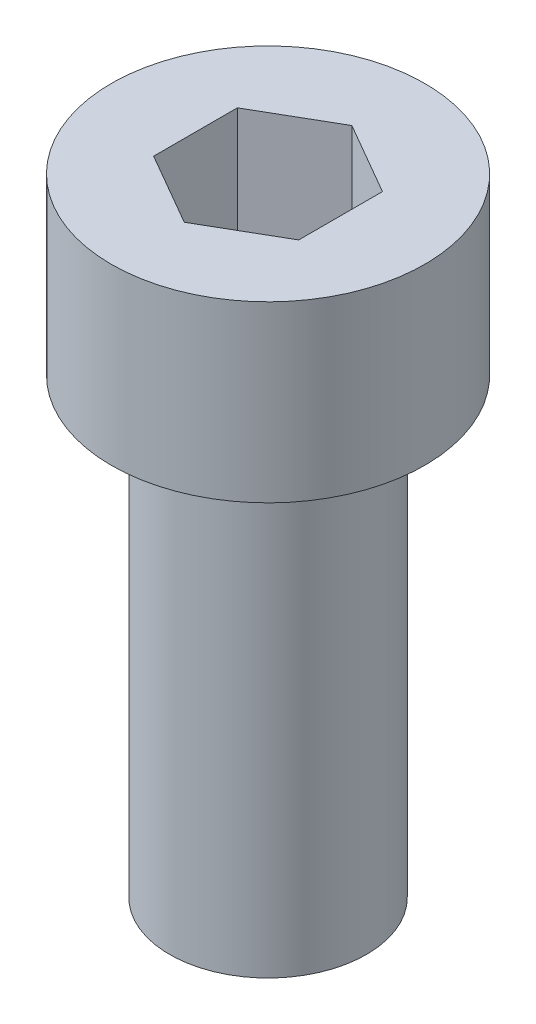
ISO-10303-21;
HEADER;
FILE_DESCRIPTION(('STEP AP214'),'2;1');
FILE_NAME('part.step','',(''),(''),'','','');
FILE_SCHEMA(('AUTOMOTIVE_DESIGN { 1 0 10303 214 1 1 1 1 }'));
ENDSEC;
DATA;
#1=APPLICATION_CONTEXT('core data for automotive mechanical design processes');
#2=APPLICATION_PROTOCOL_DEFINITION('international standard','automotive_design',2000,#1);
#3=PRODUCT_CONTEXT('',#1,'mechanical');
#4=PRODUCT('Part','Part','',(#3));
#5=PRODUCT_RELATED_PRODUCT_CATEGORY('part','',(#4));
#6=PRODUCT_DEFINITION_FORMATION('','',#4);
#7=PRODUCT_DEFINITION_CONTEXT('part definition',#1,'design');
#8=PRODUCT_DEFINITION('design','',#6,#7);
#9=PRODUCT_DEFINITION_SHAPE('','',#8);
#10=(LENGTH_UNIT() NAMED_UNIT(*) SI_UNIT(.MILLI.,.METRE.));
#11=(NAMED_UNIT(*) PLANE_ANGLE_UNIT() SI_UNIT($,.RADIAN.));
#12=(NAMED_UNIT(*) SI_UNIT($,.STERADIAN.) SOLID_ANGLE_UNIT());
#13=UNCERTAINTY_MEASURE_WITH_UNIT(LENGTH_MEASURE(1.E-05),#10,'distance_accuracy_value','');
#14=(GEOMETRIC_REPRESENTATION_CONTEXT(3) GLOBAL_UNCERTAINTY_ASSIGNED_CONTEXT((#13)) GLOBAL_UNIT_ASSIGNED_CONTEXT((#10,
#11,#12)) REPRESENTATION_CONTEXT('',''));
#15=CARTESIAN_POINT('',(0.,0.,0.));
#16=DIRECTION('',(0.,0.,1.));
#17=DIRECTION('',(1.,0.,0.));
#18=AXIS2_PLACEMENT_3D('',#15,#16,#17);
#19=CARTESIAN_POINT('',(184.714490271524,-3.,125.244295140347));
#20=DIRECTION('',(0.,1.,0.));
#21=DIRECTION('',(0.,0.,1.));
#22=AXIS2_PLACEMENT_3D('',#19,#20,#21);
#23=CYLINDRICAL_SURFACE('',#22,2.70000000000001);
#24=CARTESIAN_POINT('',(184.714490271524,-3.,125.244295140347));
#25=DIRECTION('',(0.,1.,0.));
#26=DIRECTION('',(0.,0.,1.));
#27=AXIS2_PLACEMENT_3D('',#24,#25,#26);
#28=CIRCLE('',#27,2.70000000000001);
#29=CARTESIAN_POINT('',(184.714490271524,-3.,127.944295140347));
#30=VERTEX_POINT('',#29);
#31=EDGE_CURVE('E48',#30,#30,#28,.T.);
#32=ORIENTED_EDGE('',*,*,#31,.T.);
#33=EDGE_LOOP('',(#32));
#34=FACE_BOUND('',#33,.T.);
#35=CARTESIAN_POINT('',(184.714490271524,0.,125.244295140347));
#36=DIRECTION('',(0.,1.,0.));
#37=DIRECTION('',(0.,0.,1.));
#38=AXIS2_PLACEMENT_3D('',#35,#36,#37);
#39=CIRCLE('',#38,2.70000000000001);
#40=CARTESIAN_POINT('',(184.714490271524,0.,127.944295140347));
#41=VERTEX_POINT('',#40);
#42=EDGE_CURVE('E42',#41,#41,#39,.T.);
#43=ORIENTED_EDGE('',*,*,#42,.F.);
#44=EDGE_LOOP('',(#43));
#45=FACE_BOUND('',#44,.T.);
#46=ADVANCED_FACE('F39',(#34,#45),#23,.T.);
#47=CARTESIAN_POINT('',(184.714490271524,-3.,125.244295140347));
#48=DIRECTION('',(0.,1.,0.));
#49=DIRECTION('',(0.,0.,1.));
#50=AXIS2_PLACEMENT_3D('',#47,#48,#49);
#51=PLANE('',#50);
#52=CARTESIAN_POINT('',(184.714490271524,-3.,125.244295140347));
#53=DIRECTION('',(0.,-1.,0.));
#54=DIRECTION('',(0.,0.,-1.));
#55=AXIS2_PLACEMENT_3D('',#52,#53,#54);
#56=CIRCLE('',#55,1.69629374220996);
#57=CARTESIAN_POINT('',(184.714490271524,-3.,123.548001398137));
#58=VERTEX_POINT('',#57);
#59=EDGE_CURVE('E11',#58,#58,#56,.T.);
#60=ORIENTED_EDGE('',*,*,#59,.F.);
#61=EDGE_LOOP('',(#60));
#62=FACE_BOUND('',#61,.T.);
#63=ORIENTED_EDGE('',*,*,#31,.F.);
#64=EDGE_LOOP('',(#63));
#65=FACE_BOUND('',#64,.T.);
#66=ADVANCED_FACE('F178',(#62,#65),#51,.F.);
#67=CARTESIAN_POINT('',(184.714490271524,0.,125.244295140347));
#68=DIRECTION('',(0.,1.,0.));
#69=DIRECTION('',(0.,0.,1.));
#70=AXIS2_PLACEMENT_3D('',#67,#68,#69);
#71=PLANE('',#70);
#72=DIRECTION('',(-0.866025403784435,0.,-0.500000000000006));
#73=VECTOR('',#72,1.);
#74=CARTESIAN_POINT('',(185.964490271524,0.,124.52260730386));
#75=LINE('',#74,#73);
#76=CARTESIAN_POINT('',(185.964490271524,0.,124.52260730386));
#77=VERTEX_POINT('',#76);
#78=CARTESIAN_POINT('',(184.714490271524,0.,123.800919467373));
#79=VERTEX_POINT('',#78);
#80=EDGE_CURVE('E56',#77,#79,#75,.T.);
#81=ORIENTED_EDGE('',*,*,#80,.F.);
#82=DIRECTION('',(0.,0.,-1.));
#83=VECTOR('',#82,1.);
#84=CARTESIAN_POINT('',(185.964490271524,0.,125.965982976834));
#85=LINE('',#84,#83);
#86=CARTESIAN_POINT('',(185.964490271524,0.,125.965982976834));
#87=VERTEX_POINT('',#86);
#88=EDGE_CURVE('E149',#87,#77,#85,.T.);
#89=ORIENTED_EDGE('',*,*,#88,.F.);
#90=DIRECTION('',(0.86602540378443,0.,-0.500000000000015));
#91=VECTOR('',#90,1.);
#92=CARTESIAN_POINT('',(184.714490271524,0.,126.687670813321));
#93=LINE('',#92,#91);
#94=CARTESIAN_POINT('',(184.714490271524,0.,126.687670813321));
#95=VERTEX_POINT('',#94);
#96=EDGE_CURVE('E146',#95,#87,#93,.T.);
#97=ORIENTED_EDGE('',*,*,#96,.F.);
#98=DIRECTION('',(0.866025403784436,0.,0.500000000000004));
#99=VECTOR('',#98,1.);
#100=CARTESIAN_POINT('',(183.464490271524,0.,125.965982976834));
#101=LINE('',#100,#99);
#102=CARTESIAN_POINT('',(183.464490271524,0.,125.965982976834));
#103=VERTEX_POINT('',#102);
#104=EDGE_CURVE('E104',#103,#95,#101,.T.);
#105=ORIENTED_EDGE('',*,*,#104,.F.);
#106=DIRECTION('',(0.,0.,1.));
#107=VECTOR('',#106,1.);
#108=CARTESIAN_POINT('',(183.464490271524,0.,124.52260730386));
#109=LINE('',#108,#107);
#110=CARTESIAN_POINT('',(183.464490271524,0.,124.52260730386));
#111=VERTEX_POINT('',#110);
#112=EDGE_CURVE('E140',#111,#103,#109,.T.);
#113=ORIENTED_EDGE('',*,*,#112,.F.);
#114=DIRECTION('',(-0.86602540378444,0.,0.499999999999998));
#115=VECTOR('',#114,1.);
#116=CARTESIAN_POINT('',(184.714490271524,0.,123.800919467373));
#117=LINE('',#116,#115);
#118=EDGE_CURVE('E136',#79,#111,#117,.T.);
#119=ORIENTED_EDGE('',*,*,#118,.F.);
#120=EDGE_LOOP('',(#81,#89,#97,#105,#113,#119));
#121=FACE_BOUND('',#120,.T.);
#122=ORIENTED_EDGE('',*,*,#42,.T.);
#123=EDGE_LOOP('',(#122));
#124=FACE_BOUND('',#123,.T.);
#125=ADVANCED_FACE('F175',(#121,#124),#71,.T.);
#126=CARTESIAN_POINT('',(184.714490271524,-10.8,125.244295140347));
#127=DIRECTION('',(0.,1.,0.));
#128=DIRECTION('',(0.,0.,1.));
#129=AXIS2_PLACEMENT_3D('',#126,#127,#128);
#130=CYLINDRICAL_SURFACE('',#129,1.69629374220996);
#131=CARTESIAN_POINT('',(184.714490271524,-10.8,125.244295140347));
#132=DIRECTION('',(0.,-1.,0.));
#133=DIRECTION('',(0.,0.,-1.));
#134=AXIS2_PLACEMENT_3D('',#131,#132,#133);
#135=CIRCLE('',#134,1.69629374220996);
#136=CARTESIAN_POINT('',(184.714490271524,-10.8,123.548001398137));
#137=VERTEX_POINT('',#136);
#138=EDGE_CURVE('E155',#137,#137,#135,.T.);
#139=ORIENTED_EDGE('',*,*,#138,.F.);
#140=EDGE_LOOP('',(#139));
#141=FACE_BOUND('',#140,.T.);
#142=ORIENTED_EDGE('',*,*,#59,.T.);
#143=EDGE_LOOP('',(#142));
#144=FACE_BOUND('',#143,.T.);
#145=ADVANCED_FACE('F187',(#141,#144),#130,.T.);
#146=CARTESIAN_POINT('',(184.714490271524,-10.8,125.244295140347));
#147=DIRECTION('',(0.,-1.,0.));
#148=DIRECTION('',(0.,0.,-1.));
#149=AXIS2_PLACEMENT_3D('',#146,#147,#148);
#150=PLANE('',#149);
#151=ORIENTED_EDGE('',*,*,#138,.T.);
#152=EDGE_LOOP('',(#151));
#153=FACE_BOUND('',#152,.T.);
#154=ADVANCED_FACE('F194',(#153),#150,.T.);
#155=CARTESIAN_POINT('',(185.964490271524,-2.,124.52260730386));
#156=DIRECTION('',(0.500000000000006,0.,-0.866025403784435));
#157=DIRECTION('',(-0.866025403784435,0.,-0.500000000000006));
#158=AXIS2_PLACEMENT_3D('',#155,#156,#157);
#159=PLANE('',#158);
#160=ORIENTED_EDGE('',*,*,#80,.T.);
#161=DIRECTION('',(0.,1.,0.));
#162=VECTOR('',#161,1.);
#163=CARTESIAN_POINT('',(184.714490271524,-2.,123.800919467373));
#164=LINE('',#163,#162);
#165=CARTESIAN_POINT('',(184.714490271524,-2.,123.800919467373));
#166=VERTEX_POINT('',#165);
#167=EDGE_CURVE('E86',#166,#79,#164,.T.);
#168=ORIENTED_EDGE('',*,*,#167,.F.);
#169=DIRECTION('',(-0.866025403784435,0.,-0.500000000000006));
#170=VECTOR('',#169,1.);
#171=CARTESIAN_POINT('',(185.964490271524,-2.,124.52260730386));
#172=LINE('',#171,#170);
#173=CARTESIAN_POINT('',(185.964490271524,-2.,124.52260730386));
#174=VERTEX_POINT('',#173);
#175=EDGE_CURVE('E152',#174,#166,#172,.T.);
#176=ORIENTED_EDGE('',*,*,#175,.F.);
#177=DIRECTION('',(0.,1.,0.));
#178=VECTOR('',#177,1.);
#179=CARTESIAN_POINT('',(185.964490271524,-2.,124.52260730386));
#180=LINE('',#179,#178);
#181=EDGE_CURVE('E64',#174,#77,#180,.T.);
#182=ORIENTED_EDGE('',*,*,#181,.T.);
#183=EDGE_LOOP('',(#160,#168,#176,#182));
#184=FACE_BOUND('',#183,.T.);
#185=ADVANCED_FACE('F198',(#184),#159,.F.);
#186=CARTESIAN_POINT('',(185.964490271524,-2.,125.965982976834));
#187=DIRECTION('',(1.,0.,0.));
#188=DIRECTION('',(0.,0.,-1.));
#189=AXIS2_PLACEMENT_3D('',#186,#187,#188);
#190=PLANE('',#189);
#191=ORIENTED_EDGE('',*,*,#88,.T.);
#192=ORIENTED_EDGE('',*,*,#181,.F.);
#193=DIRECTION('',(0.,0.,-1.));
#194=VECTOR('',#193,1.);
#195=CARTESIAN_POINT('',(185.964490271524,-2.,125.965982976834));
#196=LINE('',#195,#194);
#197=CARTESIAN_POINT('',(185.964490271524,-2.,125.965982976834));
#198=VERTEX_POINT('',#197);
#199=EDGE_CURVE('E118',#198,#174,#196,.T.);
#200=ORIENTED_EDGE('',*,*,#199,.F.);
#201=DIRECTION('',(0.,1.,0.));
#202=VECTOR('',#201,1.);
#203=CARTESIAN_POINT('',(185.964490271524,-2.,125.965982976834));
#204=LINE('',#203,#202);
#205=EDGE_CURVE('E109',#198,#87,#204,.T.);
#206=ORIENTED_EDGE('',*,*,#205,.T.);
#207=EDGE_LOOP('',(#191,#192,#200,#206));
#208=FACE_BOUND('',#207,.T.);
#209=ADVANCED_FACE('F202',(#208),#190,.F.);
#210=CARTESIAN_POINT('',(184.714490271524,-2.,126.687670813321));
#211=DIRECTION('',(0.500000000000015,0.,0.86602540378443));
#212=DIRECTION('',(0.86602540378443,0.,-0.500000000000015));
#213=AXIS2_PLACEMENT_3D('',#210,#211,#212);
#214=PLANE('',#213);
#215=ORIENTED_EDGE('',*,*,#96,.T.);
#216=ORIENTED_EDGE('',*,*,#205,.F.);
#217=DIRECTION('',(0.86602540378443,0.,-0.500000000000015));
#218=VECTOR('',#217,1.);
#219=CARTESIAN_POINT('',(184.714490271524,-2.,126.687670813321));
#220=LINE('',#219,#218);
#221=CARTESIAN_POINT('',(184.714490271524,-2.,126.687670813321));
#222=VERTEX_POINT('',#221);
#223=EDGE_CURVE('E113',#222,#198,#220,.T.);
#224=ORIENTED_EDGE('',*,*,#223,.F.);
#225=DIRECTION('',(0.,1.,0.));
#226=VECTOR('',#225,1.);
#227=CARTESIAN_POINT('',(184.714490271524,-2.,126.687670813321));
#228=LINE('',#227,#226);
#229=EDGE_CURVE('E97',#222,#95,#228,.T.);
#230=ORIENTED_EDGE('',*,*,#229,.T.);
#231=EDGE_LOOP('',(#215,#216,#224,#230));
#232=FACE_BOUND('',#231,.T.);
#233=ADVANCED_FACE('F114',(#232),#214,.F.);
#234=CARTESIAN_POINT('',(183.464490271524,-2.,125.965982976834));
#235=DIRECTION('',(-0.500000000000004,0.,0.866025403784436));
#236=DIRECTION('',(0.866025403784436,0.,0.500000000000004));
#237=AXIS2_PLACEMENT_3D('',#234,#235,#236);
#238=PLANE('',#237);
#239=ORIENTED_EDGE('',*,*,#104,.T.);
#240=ORIENTED_EDGE('',*,*,#229,.F.);
#241=DIRECTION('',(0.866025403784436,0.,0.500000000000004));
#242=VECTOR('',#241,1.);
#243=CARTESIAN_POINT('',(183.464490271524,-2.,125.965982976834));
#244=LINE('',#243,#242);
#245=CARTESIAN_POINT('',(183.464490271524,-2.,125.965982976834));
#246=VERTEX_POINT('',#245);
#247=EDGE_CURVE('E101',#246,#222,#244,.T.);
#248=ORIENTED_EDGE('',*,*,#247,.F.);
#249=DIRECTION('',(0.,1.,0.));
#250=VECTOR('',#249,1.);
#251=CARTESIAN_POINT('',(183.464490271524,-2.,125.965982976834));
#252=LINE('',#251,#250);
#253=EDGE_CURVE('E110',#246,#103,#252,.T.);
#254=ORIENTED_EDGE('',*,*,#253,.T.);
#255=EDGE_LOOP('',(#239,#240,#248,#254));
#256=FACE_BOUND('',#255,.T.);
#257=ADVANCED_FACE('F99',(#256),#238,.F.);
#258=CARTESIAN_POINT('',(183.464490271524,-2.,124.52260730386));
#259=DIRECTION('',(-1.,0.,0.));
#260=DIRECTION('',(0.,0.,1.));
#261=AXIS2_PLACEMENT_3D('',#258,#259,#260);
#262=PLANE('',#261);
#263=ORIENTED_EDGE('',*,*,#112,.T.);
#264=ORIENTED_EDGE('',*,*,#253,.F.);
#265=DIRECTION('',(0.,0.,1.));
#266=VECTOR('',#265,1.);
#267=CARTESIAN_POINT('',(183.464490271524,-2.,124.52260730386));
#268=LINE('',#267,#266);
#269=CARTESIAN_POINT('',(183.464490271524,-2.,124.52260730386));
#270=VERTEX_POINT('',#269);
#271=EDGE_CURVE('E124',#270,#246,#268,.T.);
#272=ORIENTED_EDGE('',*,*,#271,.F.);
#273=DIRECTION('',(0.,1.,0.));
#274=VECTOR('',#273,1.);
#275=CARTESIAN_POINT('',(183.464490271524,-2.,124.52260730386));
#276=LINE('',#275,#274);
#277=EDGE_CURVE('E160',#270,#111,#276,.T.);
#278=ORIENTED_EDGE('',*,*,#277,.T.);
#279=EDGE_LOOP('',(#263,#264,#272,#278));
#280=FACE_BOUND('',#279,.T.);
#281=ADVANCED_FACE('F206',(#280),#262,.F.);
#282=CARTESIAN_POINT('',(184.714490271524,-2.,123.800919467373));
#283=DIRECTION('',(-0.499999999999998,0.,-0.86602540378444));
#284=DIRECTION('',(-0.86602540378444,0.,0.499999999999998));
#285=AXIS2_PLACEMENT_3D('',#282,#283,#284);
#286=PLANE('',#285);
#287=ORIENTED_EDGE('',*,*,#118,.T.);
#288=ORIENTED_EDGE('',*,*,#277,.F.);
#289=DIRECTION('',(-0.86602540378444,0.,0.499999999999998));
#290=VECTOR('',#289,1.);
#291=CARTESIAN_POINT('',(184.714490271524,-2.,123.800919467373));
#292=LINE('',#291,#290);
#293=EDGE_CURVE('E128',#166,#270,#292,.T.);
#294=ORIENTED_EDGE('',*,*,#293,.F.);
#295=ORIENTED_EDGE('',*,*,#167,.T.);
#296=EDGE_LOOP('',(#287,#288,#294,#295));
#297=FACE_BOUND('',#296,.T.);
#298=ADVANCED_FACE('F203',(#297),#286,.F.);
#299=CARTESIAN_POINT('',(0.,-2.,0.));
#300=DIRECTION('',(0.,1.,0.));
#301=DIRECTION('',(0.,0.,1.));
#302=AXIS2_PLACEMENT_3D('',#299,#300,#301);
#303=PLANE('',#302);
#304=ORIENTED_EDGE('',*,*,#175,.T.);
#305=ORIENTED_EDGE('',*,*,#293,.T.);
#306=ORIENTED_EDGE('',*,*,#271,.T.);
#307=ORIENTED_EDGE('',*,*,#247,.T.);
#308=ORIENTED_EDGE('',*,*,#223,.T.);
#309=ORIENTED_EDGE('',*,*,#199,.T.);
#310=EDGE_LOOP('',(#304,#305,#306,#307,#308,#309));
#311=FACE_BOUND('',#310,.T.);
#312=ADVANCED_FACE('F121',(#311),#303,.T.);
#313=CLOSED_SHELL('',(#46,#66,#125,#145,#154,#185,#209,#233,#257,#281,#298,#312));
#314=MANIFOLD_SOLID_BREP('B2',#313);
#315=ADVANCED_BREP_SHAPE_REPRESENTATION('',(#18,#314),#14);
#316=SHAPE_DEFINITION_REPRESENTATION(#9,#315);
ENDSEC;
END-ISO-10303-21;
